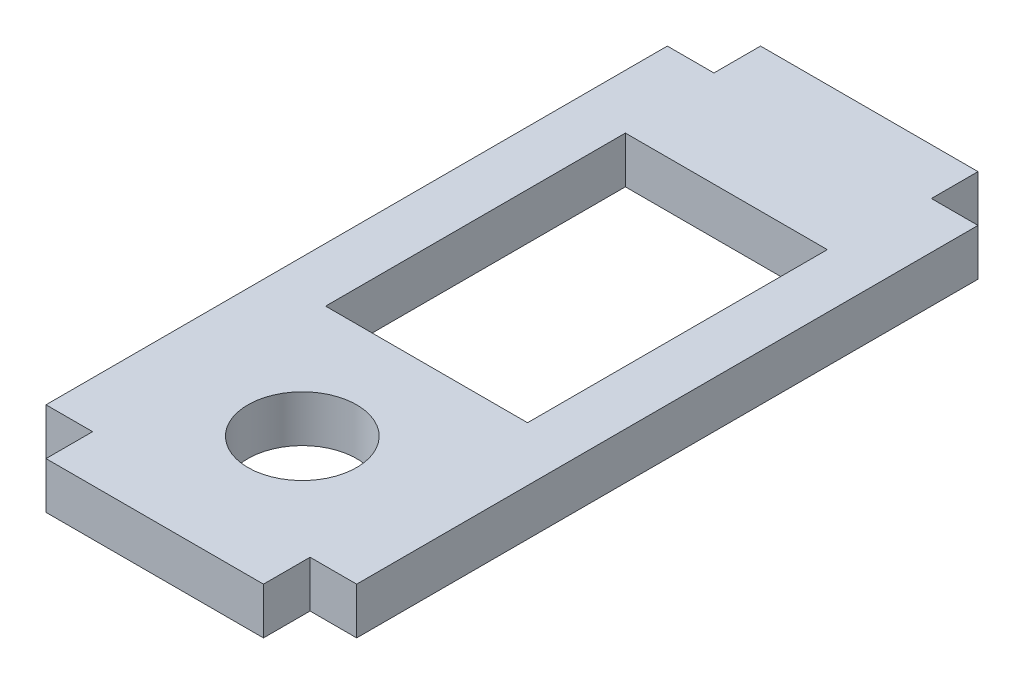
ISO-10303-21;
HEADER;
FILE_DESCRIPTION(('STEP AP214'),'2;1');
FILE_NAME('part.step','',(''),(''),'','','');
FILE_SCHEMA(('AUTOMOTIVE_DESIGN { 1 0 10303 214 1 1 1 1 }'));
ENDSEC;
DATA;
#1=APPLICATION_CONTEXT('core data for automotive mechanical design processes');
#2=APPLICATION_PROTOCOL_DEFINITION('international standard','automotive_design',2000,#1);
#3=PRODUCT_CONTEXT('',#1,'mechanical');
#4=PRODUCT('Part','Part','',(#3));
#5=PRODUCT_RELATED_PRODUCT_CATEGORY('part','',(#4));
#6=PRODUCT_DEFINITION_FORMATION('','',#4);
#7=PRODUCT_DEFINITION_CONTEXT('part definition',#1,'design');
#8=PRODUCT_DEFINITION('design','',#6,#7);
#9=PRODUCT_DEFINITION_SHAPE('','',#8);
#10=(LENGTH_UNIT() NAMED_UNIT(*) SI_UNIT(.MILLI.,.METRE.));
#11=(NAMED_UNIT(*) PLANE_ANGLE_UNIT() SI_UNIT($,.RADIAN.));
#12=(NAMED_UNIT(*) SI_UNIT($,.STERADIAN.) SOLID_ANGLE_UNIT());
#13=UNCERTAINTY_MEASURE_WITH_UNIT(LENGTH_MEASURE(1.E-05),#10,'distance_accuracy_value','');
#14=(GEOMETRIC_REPRESENTATION_CONTEXT(3) GLOBAL_UNCERTAINTY_ASSIGNED_CONTEXT((#13)) GLOBAL_UNIT_ASSIGNED_CONTEXT((#10,
#11,#12)) REPRESENTATION_CONTEXT('',''));
#15=CARTESIAN_POINT('',(0.,0.,0.));
#16=DIRECTION('',(0.,0.,1.));
#17=DIRECTION('',(1.,0.,0.));
#18=AXIS2_PLACEMENT_3D('',#15,#16,#17);
#19=CARTESIAN_POINT('',(0.,3.,0.));
#20=DIRECTION('',(0.,1.,0.));
#21=DIRECTION('',(0.,0.,1.));
#22=AXIS2_PLACEMENT_3D('',#19,#20,#21);
#23=PLANE('',#22);
#24=DIRECTION('',(1.,0.,0.));
#25=VECTOR('',#24,1.);
#26=CARTESIAN_POINT('',(-6.5,3.,5.5));
#27=LINE('',#26,#25);
#28=CARTESIAN_POINT('',(-6.5,3.,5.5));
#29=VERTEX_POINT('',#28);
#30=CARTESIAN_POINT('',(6.5,3.,5.5));
#31=VERTEX_POINT('',#30);
#32=EDGE_CURVE('E154',#29,#31,#27,.T.);
#33=ORIENTED_EDGE('',*,*,#32,.F.);
#34=DIRECTION('',(0.,0.,1.));
#35=VECTOR('',#34,1.);
#36=CARTESIAN_POINT('',(-6.5,3.,-13.8));
#37=LINE('',#36,#35);
#38=CARTESIAN_POINT('',(-6.5,3.,-13.8));
#39=VERTEX_POINT('',#38);
#40=EDGE_CURVE('E146',#39,#29,#37,.T.);
#41=ORIENTED_EDGE('',*,*,#40,.F.);
#42=DIRECTION('',(-1.,0.,0.));
#43=VECTOR('',#42,1.);
#44=CARTESIAN_POINT('',(-6.5,3.,-13.8));
#45=LINE('',#44,#43);
#46=CARTESIAN_POINT('',(6.5,3.,-13.8));
#47=VERTEX_POINT('',#46);
#48=EDGE_CURVE('E169',#47,#39,#45,.T.);
#49=ORIENTED_EDGE('',*,*,#48,.F.);
#50=DIRECTION('',(0.,0.,-1.));
#51=VECTOR('',#50,1.);
#52=CARTESIAN_POINT('',(6.5,3.,-13.8));
#53=LINE('',#52,#51);
#54=EDGE_CURVE('E167',#31,#47,#53,.T.);
#55=ORIENTED_EDGE('',*,*,#54,.F.);
#56=EDGE_LOOP('',(#33,#41,#49,#55));
#57=FACE_BOUND('',#56,.T.);
#58=DIRECTION('',(0.,0.,1.));
#59=VECTOR('',#58,1.);
#60=CARTESIAN_POINT('',(-10.,3.,-20.));
#61=LINE('',#60,#59);
#62=CARTESIAN_POINT('',(-10.,3.,-20.));
#63=VERTEX_POINT('',#62);
#64=CARTESIAN_POINT('',(-10.,3.,20.));
#65=VERTEX_POINT('',#64);
#66=EDGE_CURVE('E185',#63,#65,#61,.T.);
#67=ORIENTED_EDGE('',*,*,#66,.T.);
#68=DIRECTION('',(1.,0.,0.));
#69=VECTOR('',#68,1.);
#70=CARTESIAN_POINT('',(-10.,3.,20.));
#71=LINE('',#70,#69);
#72=CARTESIAN_POINT('',(-7.,3.,20.));
#73=VERTEX_POINT('',#72);
#74=EDGE_CURVE('E188',#65,#73,#71,.T.);
#75=ORIENTED_EDGE('',*,*,#74,.T.);
#76=DIRECTION('',(0.,0.,1.));
#77=VECTOR('',#76,1.);
#78=CARTESIAN_POINT('',(-7.,3.,20.));
#79=LINE('',#78,#77);
#80=CARTESIAN_POINT('',(-7.,3.,23.));
#81=VERTEX_POINT('',#80);
#82=EDGE_CURVE('E191',#73,#81,#79,.T.);
#83=ORIENTED_EDGE('',*,*,#82,.T.);
#84=DIRECTION('',(1.,0.,0.));
#85=VECTOR('',#84,1.);
#86=CARTESIAN_POINT('',(-7.,3.,23.));
#87=LINE('',#86,#85);
#88=CARTESIAN_POINT('',(7.,3.,23.));
#89=VERTEX_POINT('',#88);
#90=EDGE_CURVE('E193',#81,#89,#87,.T.);
#91=ORIENTED_EDGE('',*,*,#90,.T.);
#92=DIRECTION('',(0.,0.,-1.));
#93=VECTOR('',#92,1.);
#94=CARTESIAN_POINT('',(7.,3.,20.));
#95=LINE('',#94,#93);
#96=CARTESIAN_POINT('',(7.,3.,20.));
#97=VERTEX_POINT('',#96);
#98=EDGE_CURVE('E195',#89,#97,#95,.T.);
#99=ORIENTED_EDGE('',*,*,#98,.T.);
#100=DIRECTION('',(1.,0.,0.));
#101=VECTOR('',#100,1.);
#102=CARTESIAN_POINT('',(7.,3.,20.));
#103=LINE('',#102,#101);
#104=CARTESIAN_POINT('',(10.,3.,20.));
#105=VERTEX_POINT('',#104);
#106=EDGE_CURVE('E197',#97,#105,#103,.T.);
#107=ORIENTED_EDGE('',*,*,#106,.T.);
#108=DIRECTION('',(0.,0.,-1.));
#109=VECTOR('',#108,1.);
#110=CARTESIAN_POINT('',(10.,3.,-20.));
#111=LINE('',#110,#109);
#112=CARTESIAN_POINT('',(10.,3.,-20.));
#113=VERTEX_POINT('',#112);
#114=EDGE_CURVE('E199',#105,#113,#111,.T.);
#115=ORIENTED_EDGE('',*,*,#114,.T.);
#116=DIRECTION('',(-1.,0.,0.));
#117=VECTOR('',#116,1.);
#118=CARTESIAN_POINT('',(7.,3.,-20.));
#119=LINE('',#118,#117);
#120=CARTESIAN_POINT('',(7.,3.,-20.));
#121=VERTEX_POINT('',#120);
#122=EDGE_CURVE('E201',#113,#121,#119,.T.);
#123=ORIENTED_EDGE('',*,*,#122,.T.);
#124=DIRECTION('',(0.,0.,-1.));
#125=VECTOR('',#124,1.);
#126=CARTESIAN_POINT('',(7.,3.,-23.));
#127=LINE('',#126,#125);
#128=CARTESIAN_POINT('',(7.,3.,-23.));
#129=VERTEX_POINT('',#128);
#130=EDGE_CURVE('E203',#121,#129,#127,.T.);
#131=ORIENTED_EDGE('',*,*,#130,.T.);
#132=DIRECTION('',(-1.,0.,0.));
#133=VECTOR('',#132,1.);
#134=CARTESIAN_POINT('',(-7.,3.,-23.));
#135=LINE('',#134,#133);
#136=CARTESIAN_POINT('',(-7.,3.,-23.));
#137=VERTEX_POINT('',#136);
#138=EDGE_CURVE('E205',#129,#137,#135,.T.);
#139=ORIENTED_EDGE('',*,*,#138,.T.);
#140=DIRECTION('',(0.,0.,1.));
#141=VECTOR('',#140,1.);
#142=CARTESIAN_POINT('',(-7.,3.,-23.));
#143=LINE('',#142,#141);
#144=CARTESIAN_POINT('',(-7.,3.,-20.));
#145=VERTEX_POINT('',#144);
#146=EDGE_CURVE('E207',#137,#145,#143,.T.);
#147=ORIENTED_EDGE('',*,*,#146,.T.);
#148=DIRECTION('',(-1.,0.,0.));
#149=VECTOR('',#148,1.);
#150=CARTESIAN_POINT('',(-10.,3.,-20.));
#151=LINE('',#150,#149);
#152=EDGE_CURVE('E209',#145,#63,#151,.T.);
#153=ORIENTED_EDGE('',*,*,#152,.T.);
#154=EDGE_LOOP('',(#67,#75,#83,#91,#99,#107,#115,#123,#131,#139,#147,#153));
#155=FACE_BOUND('',#154,.T.);
#156=CARTESIAN_POINT('',(0.,3.,13.5));
#157=DIRECTION('',(0.,1.,0.));
#158=DIRECTION('',(0.,0.,1.));
#159=AXIS2_PLACEMENT_3D('',#156,#157,#158);
#160=CIRCLE('',#159,3.5);
#161=CARTESIAN_POINT('',(0.,3.,17.));
#162=VERTEX_POINT('',#161);
#163=EDGE_CURVE('E175',#162,#162,#160,.T.);
#164=ORIENTED_EDGE('',*,*,#163,.F.);
#165=EDGE_LOOP('',(#164));
#166=FACE_BOUND('',#165,.T.);
#167=ADVANCED_FACE('F33',(#57,#155,#166),#23,.T.);
#168=CARTESIAN_POINT('',(0.,0.,0.));
#169=DIRECTION('',(0.,1.,0.));
#170=DIRECTION('',(0.,0.,1.));
#171=AXIS2_PLACEMENT_3D('',#168,#169,#170);
#172=PLANE('',#171);
#173=DIRECTION('',(0.,0.,1.));
#174=VECTOR('',#173,1.);
#175=CARTESIAN_POINT('',(-6.5,0.,-13.8));
#176=LINE('',#175,#174);
#177=CARTESIAN_POINT('',(-6.5,0.,-13.8));
#178=VERTEX_POINT('',#177);
#179=CARTESIAN_POINT('',(-6.5,0.,5.5));
#180=VERTEX_POINT('',#179);
#181=EDGE_CURVE('E56',#178,#180,#176,.T.);
#182=ORIENTED_EDGE('',*,*,#181,.T.);
#183=DIRECTION('',(1.,0.,0.));
#184=VECTOR('',#183,1.);
#185=CARTESIAN_POINT('',(-6.5,0.,5.5));
#186=LINE('',#185,#184);
#187=CARTESIAN_POINT('',(6.5,0.,5.5));
#188=VERTEX_POINT('',#187);
#189=EDGE_CURVE('E161',#180,#188,#186,.T.);
#190=ORIENTED_EDGE('',*,*,#189,.T.);
#191=DIRECTION('',(0.,0.,-1.));
#192=VECTOR('',#191,1.);
#193=CARTESIAN_POINT('',(6.5,0.,-13.8));
#194=LINE('',#193,#192);
#195=CARTESIAN_POINT('',(6.5,0.,-13.8));
#196=VERTEX_POINT('',#195);
#197=EDGE_CURVE('E177',#188,#196,#194,.T.);
#198=ORIENTED_EDGE('',*,*,#197,.T.);
#199=DIRECTION('',(-1.,0.,0.));
#200=VECTOR('',#199,1.);
#201=CARTESIAN_POINT('',(-6.5,0.,-13.8));
#202=LINE('',#201,#200);
#203=EDGE_CURVE('E155',#196,#178,#202,.T.);
#204=ORIENTED_EDGE('',*,*,#203,.T.);
#205=EDGE_LOOP('',(#182,#190,#198,#204));
#206=FACE_BOUND('',#205,.T.);
#207=DIRECTION('',(0.,0.,1.));
#208=VECTOR('',#207,1.);
#209=CARTESIAN_POINT('',(-10.,0.,-20.));
#210=LINE('',#209,#208);
#211=CARTESIAN_POINT('',(-10.,0.,-20.));
#212=VERTEX_POINT('',#211);
#213=CARTESIAN_POINT('',(-10.,0.,20.));
#214=VERTEX_POINT('',#213);
#215=EDGE_CURVE('E162',#212,#214,#210,.T.);
#216=ORIENTED_EDGE('',*,*,#215,.F.);
#217=DIRECTION('',(-1.,0.,0.));
#218=VECTOR('',#217,1.);
#219=CARTESIAN_POINT('',(-10.,0.,-20.));
#220=LINE('',#219,#218);
#221=CARTESIAN_POINT('',(-7.,0.,-20.));
#222=VERTEX_POINT('',#221);
#223=EDGE_CURVE('E189',#222,#212,#220,.T.);
#224=ORIENTED_EDGE('',*,*,#223,.F.);
#225=DIRECTION('',(0.,0.,1.));
#226=VECTOR('',#225,1.);
#227=CARTESIAN_POINT('',(-7.,0.,-23.));
#228=LINE('',#227,#226);
#229=CARTESIAN_POINT('',(-7.,0.,-23.));
#230=VERTEX_POINT('',#229);
#231=EDGE_CURVE('E232',#230,#222,#228,.T.);
#232=ORIENTED_EDGE('',*,*,#231,.F.);
#233=DIRECTION('',(-1.,0.,0.));
#234=VECTOR('',#233,1.);
#235=CARTESIAN_POINT('',(-7.,0.,-23.));
#236=LINE('',#235,#234);
#237=CARTESIAN_POINT('',(7.,0.,-23.));
#238=VERTEX_POINT('',#237);
#239=EDGE_CURVE('E230',#238,#230,#236,.T.);
#240=ORIENTED_EDGE('',*,*,#239,.F.);
#241=DIRECTION('',(0.,0.,-1.));
#242=VECTOR('',#241,1.);
#243=CARTESIAN_POINT('',(7.,0.,-23.));
#244=LINE('',#243,#242);
#245=CARTESIAN_POINT('',(7.,0.,-20.));
#246=VERTEX_POINT('',#245);
#247=EDGE_CURVE('E228',#246,#238,#244,.T.);
#248=ORIENTED_EDGE('',*,*,#247,.F.);
#249=DIRECTION('',(-1.,0.,0.));
#250=VECTOR('',#249,1.);
#251=CARTESIAN_POINT('',(7.,0.,-20.));
#252=LINE('',#251,#250);
#253=CARTESIAN_POINT('',(10.,0.,-20.));
#254=VERTEX_POINT('',#253);
#255=EDGE_CURVE('E226',#254,#246,#252,.T.);
#256=ORIENTED_EDGE('',*,*,#255,.F.);
#257=DIRECTION('',(0.,0.,-1.));
#258=VECTOR('',#257,1.);
#259=CARTESIAN_POINT('',(10.,0.,-20.));
#260=LINE('',#259,#258);
#261=CARTESIAN_POINT('',(10.,0.,20.));
#262=VERTEX_POINT('',#261);
#263=EDGE_CURVE('E224',#262,#254,#260,.T.);
#264=ORIENTED_EDGE('',*,*,#263,.F.);
#265=DIRECTION('',(1.,0.,0.));
#266=VECTOR('',#265,1.);
#267=CARTESIAN_POINT('',(7.,0.,20.));
#268=LINE('',#267,#266);
#269=CARTESIAN_POINT('',(7.,0.,20.));
#270=VERTEX_POINT('',#269);
#271=EDGE_CURVE('E222',#270,#262,#268,.T.);
#272=ORIENTED_EDGE('',*,*,#271,.F.);
#273=DIRECTION('',(0.,0.,-1.));
#274=VECTOR('',#273,1.);
#275=CARTESIAN_POINT('',(7.,0.,20.));
#276=LINE('',#275,#274);
#277=CARTESIAN_POINT('',(7.,0.,23.));
#278=VERTEX_POINT('',#277);
#279=EDGE_CURVE('E220',#278,#270,#276,.T.);
#280=ORIENTED_EDGE('',*,*,#279,.F.);
#281=DIRECTION('',(1.,0.,0.));
#282=VECTOR('',#281,1.);
#283=CARTESIAN_POINT('',(-7.,0.,23.));
#284=LINE('',#283,#282);
#285=CARTESIAN_POINT('',(-7.,0.,23.));
#286=VERTEX_POINT('',#285);
#287=EDGE_CURVE('E218',#286,#278,#284,.T.);
#288=ORIENTED_EDGE('',*,*,#287,.F.);
#289=DIRECTION('',(0.,0.,1.));
#290=VECTOR('',#289,1.);
#291=CARTESIAN_POINT('',(-7.,0.,20.));
#292=LINE('',#291,#290);
#293=CARTESIAN_POINT('',(-7.,0.,20.));
#294=VERTEX_POINT('',#293);
#295=EDGE_CURVE('E216',#294,#286,#292,.T.);
#296=ORIENTED_EDGE('',*,*,#295,.F.);
#297=DIRECTION('',(1.,0.,0.));
#298=VECTOR('',#297,1.);
#299=CARTESIAN_POINT('',(-10.,0.,20.));
#300=LINE('',#299,#298);
#301=EDGE_CURVE('E214',#214,#294,#300,.T.);
#302=ORIENTED_EDGE('',*,*,#301,.F.);
#303=EDGE_LOOP('',(#216,#224,#232,#240,#248,#256,#264,#272,#280,#288,#296,#302));
#304=FACE_BOUND('',#303,.T.);
#305=CARTESIAN_POINT('',(0.,0.,13.5));
#306=DIRECTION('',(0.,1.,0.));
#307=DIRECTION('',(0.,0.,1.));
#308=AXIS2_PLACEMENT_3D('',#305,#306,#307);
#309=CIRCLE('',#308,3.5);
#310=CARTESIAN_POINT('',(0.,0.,17.));
#311=VERTEX_POINT('',#310);
#312=EDGE_CURVE('E486',#311,#311,#309,.T.);
#313=ORIENTED_EDGE('',*,*,#312,.T.);
#314=EDGE_LOOP('',(#313));
#315=FACE_BOUND('',#314,.T.);
#316=ADVANCED_FACE('F274',(#206,#304,#315),#172,.F.);
#317=CARTESIAN_POINT('',(-10.,3.,-20.));
#318=DIRECTION('',(1.,0.,0.));
#319=DIRECTION('',(0.,0.,-1.));
#320=AXIS2_PLACEMENT_3D('',#317,#318,#319);
#321=PLANE('',#320);
#322=ORIENTED_EDGE('',*,*,#215,.T.);
#323=DIRECTION('',(0.,-1.,0.));
#324=VECTOR('',#323,1.);
#325=CARTESIAN_POINT('',(-10.,3.,20.));
#326=LINE('',#325,#324);
#327=EDGE_CURVE('E11',#65,#214,#326,.T.);
#328=ORIENTED_EDGE('',*,*,#327,.F.);
#329=ORIENTED_EDGE('',*,*,#66,.F.);
#330=DIRECTION('',(0.,-1.,0.));
#331=VECTOR('',#330,1.);
#332=CARTESIAN_POINT('',(-10.,3.,-20.));
#333=LINE('',#332,#331);
#334=EDGE_CURVE('E211',#63,#212,#333,.T.);
#335=ORIENTED_EDGE('',*,*,#334,.T.);
#336=EDGE_LOOP('',(#322,#328,#329,#335));
#337=FACE_BOUND('',#336,.T.);
#338=ADVANCED_FACE('F35',(#337),#321,.F.);
#339=CARTESIAN_POINT('',(-10.,3.,20.));
#340=DIRECTION('',(0.,0.,-1.));
#341=DIRECTION('',(-1.,0.,0.));
#342=AXIS2_PLACEMENT_3D('',#339,#340,#341);
#343=PLANE('',#342);
#344=ORIENTED_EDGE('',*,*,#301,.T.);
#345=DIRECTION('',(0.,-1.,0.));
#346=VECTOR('',#345,1.);
#347=CARTESIAN_POINT('',(-7.,3.,20.));
#348=LINE('',#347,#346);
#349=EDGE_CURVE('E41',#73,#294,#348,.T.);
#350=ORIENTED_EDGE('',*,*,#349,.F.);
#351=ORIENTED_EDGE('',*,*,#74,.F.);
#352=ORIENTED_EDGE('',*,*,#327,.T.);
#353=EDGE_LOOP('',(#344,#350,#351,#352));
#354=FACE_BOUND('',#353,.T.);
#355=ADVANCED_FACE('F291',(#354),#343,.F.);
#356=CARTESIAN_POINT('',(-7.,3.,20.));
#357=DIRECTION('',(1.,0.,0.));
#358=DIRECTION('',(0.,0.,-1.));
#359=AXIS2_PLACEMENT_3D('',#356,#357,#358);
#360=PLANE('',#359);
#361=ORIENTED_EDGE('',*,*,#295,.T.);
#362=DIRECTION('',(0.,-1.,0.));
#363=VECTOR('',#362,1.);
#364=CARTESIAN_POINT('',(-7.,3.,23.));
#365=LINE('',#364,#363);
#366=EDGE_CURVE('E261',#81,#286,#365,.T.);
#367=ORIENTED_EDGE('',*,*,#366,.F.);
#368=ORIENTED_EDGE('',*,*,#82,.F.);
#369=ORIENTED_EDGE('',*,*,#349,.T.);
#370=EDGE_LOOP('',(#361,#367,#368,#369));
#371=FACE_BOUND('',#370,.T.);
#372=ADVANCED_FACE('F268',(#371),#360,.F.);
#373=CARTESIAN_POINT('',(-7.,3.,23.));
#374=DIRECTION('',(0.,0.,-1.));
#375=DIRECTION('',(-1.,0.,0.));
#376=AXIS2_PLACEMENT_3D('',#373,#374,#375);
#377=PLANE('',#376);
#378=ORIENTED_EDGE('',*,*,#287,.T.);
#379=DIRECTION('',(0.,-1.,0.));
#380=VECTOR('',#379,1.);
#381=CARTESIAN_POINT('',(7.,3.,23.));
#382=LINE('',#381,#380);
#383=EDGE_CURVE('E258',#89,#278,#382,.T.);
#384=ORIENTED_EDGE('',*,*,#383,.F.);
#385=ORIENTED_EDGE('',*,*,#90,.F.);
#386=ORIENTED_EDGE('',*,*,#366,.T.);
#387=EDGE_LOOP('',(#378,#384,#385,#386));
#388=FACE_BOUND('',#387,.T.);
#389=ADVANCED_FACE('F280',(#388),#377,.F.);
#390=CARTESIAN_POINT('',(7.,3.,20.));
#391=DIRECTION('',(-1.,0.,0.));
#392=DIRECTION('',(0.,0.,1.));
#393=AXIS2_PLACEMENT_3D('',#390,#391,#392);
#394=PLANE('',#393);
#395=ORIENTED_EDGE('',*,*,#279,.T.);
#396=DIRECTION('',(0.,-1.,0.));
#397=VECTOR('',#396,1.);
#398=CARTESIAN_POINT('',(7.,3.,20.));
#399=LINE('',#398,#397);
#400=EDGE_CURVE('E255',#97,#270,#399,.T.);
#401=ORIENTED_EDGE('',*,*,#400,.F.);
#402=ORIENTED_EDGE('',*,*,#98,.F.);
#403=ORIENTED_EDGE('',*,*,#383,.T.);
#404=EDGE_LOOP('',(#395,#401,#402,#403));
#405=FACE_BOUND('',#404,.T.);
#406=ADVANCED_FACE('F284',(#405),#394,.F.);
#407=CARTESIAN_POINT('',(7.,3.,20.));
#408=DIRECTION('',(0.,0.,-1.));
#409=DIRECTION('',(-1.,0.,0.));
#410=AXIS2_PLACEMENT_3D('',#407,#408,#409);
#411=PLANE('',#410);
#412=ORIENTED_EDGE('',*,*,#271,.T.);
#413=DIRECTION('',(0.,-1.,0.));
#414=VECTOR('',#413,1.);
#415=CARTESIAN_POINT('',(10.,3.,20.));
#416=LINE('',#415,#414);
#417=EDGE_CURVE('E252',#105,#262,#416,.T.);
#418=ORIENTED_EDGE('',*,*,#417,.F.);
#419=ORIENTED_EDGE('',*,*,#106,.F.);
#420=ORIENTED_EDGE('',*,*,#400,.T.);
#421=EDGE_LOOP('',(#412,#418,#419,#420));
#422=FACE_BOUND('',#421,.T.);
#423=ADVANCED_FACE('F324',(#422),#411,.F.);
#424=CARTESIAN_POINT('',(10.,3.,-20.));
#425=DIRECTION('',(-1.,0.,0.));
#426=DIRECTION('',(0.,0.,1.));
#427=AXIS2_PLACEMENT_3D('',#424,#425,#426);
#428=PLANE('',#427);
#429=ORIENTED_EDGE('',*,*,#263,.T.);
#430=DIRECTION('',(0.,-1.,0.));
#431=VECTOR('',#430,1.);
#432=CARTESIAN_POINT('',(10.,3.,-20.));
#433=LINE('',#432,#431);
#434=EDGE_CURVE('E249',#113,#254,#433,.T.);
#435=ORIENTED_EDGE('',*,*,#434,.F.);
#436=ORIENTED_EDGE('',*,*,#114,.F.);
#437=ORIENTED_EDGE('',*,*,#417,.T.);
#438=EDGE_LOOP('',(#429,#435,#436,#437));
#439=FACE_BOUND('',#438,.T.);
#440=ADVANCED_FACE('F322',(#439),#428,.F.);
#441=CARTESIAN_POINT('',(7.,3.,-20.));
#442=DIRECTION('',(0.,0.,1.));
#443=DIRECTION('',(1.,0.,0.));
#444=AXIS2_PLACEMENT_3D('',#441,#442,#443);
#445=PLANE('',#444);
#446=ORIENTED_EDGE('',*,*,#255,.T.);
#447=DIRECTION('',(0.,-1.,0.));
#448=VECTOR('',#447,1.);
#449=CARTESIAN_POINT('',(7.,3.,-20.));
#450=LINE('',#449,#448);
#451=EDGE_CURVE('E246',#121,#246,#450,.T.);
#452=ORIENTED_EDGE('',*,*,#451,.F.);
#453=ORIENTED_EDGE('',*,*,#122,.F.);
#454=ORIENTED_EDGE('',*,*,#434,.T.);
#455=EDGE_LOOP('',(#446,#452,#453,#454));
#456=FACE_BOUND('',#455,.T.);
#457=ADVANCED_FACE('F318',(#456),#445,.F.);
#458=CARTESIAN_POINT('',(7.,3.,-23.));
#459=DIRECTION('',(-1.,0.,0.));
#460=DIRECTION('',(0.,0.,1.));
#461=AXIS2_PLACEMENT_3D('',#458,#459,#460);
#462=PLANE('',#461);
#463=ORIENTED_EDGE('',*,*,#247,.T.);
#464=DIRECTION('',(0.,-1.,0.));
#465=VECTOR('',#464,1.);
#466=CARTESIAN_POINT('',(7.,3.,-23.));
#467=LINE('',#466,#465);
#468=EDGE_CURVE('E243',#129,#238,#467,.T.);
#469=ORIENTED_EDGE('',*,*,#468,.F.);
#470=ORIENTED_EDGE('',*,*,#130,.F.);
#471=ORIENTED_EDGE('',*,*,#451,.T.);
#472=EDGE_LOOP('',(#463,#469,#470,#471));
#473=FACE_BOUND('',#472,.T.);
#474=ADVANCED_FACE('F313',(#473),#462,.F.);
#475=CARTESIAN_POINT('',(-7.,3.,-23.));
#476=DIRECTION('',(0.,0.,1.));
#477=DIRECTION('',(1.,0.,0.));
#478=AXIS2_PLACEMENT_3D('',#475,#476,#477);
#479=PLANE('',#478);
#480=ORIENTED_EDGE('',*,*,#239,.T.);
#481=DIRECTION('',(0.,-1.,0.));
#482=VECTOR('',#481,1.);
#483=CARTESIAN_POINT('',(-7.,3.,-23.));
#484=LINE('',#483,#482);
#485=EDGE_CURVE('E240',#137,#230,#484,.T.);
#486=ORIENTED_EDGE('',*,*,#485,.F.);
#487=ORIENTED_EDGE('',*,*,#138,.F.);
#488=ORIENTED_EDGE('',*,*,#468,.T.);
#489=EDGE_LOOP('',(#480,#486,#487,#488));
#490=FACE_BOUND('',#489,.T.);
#491=ADVANCED_FACE('F307',(#490),#479,.F.);
#492=CARTESIAN_POINT('',(-7.,3.,-23.));
#493=DIRECTION('',(1.,0.,0.));
#494=DIRECTION('',(0.,0.,-1.));
#495=AXIS2_PLACEMENT_3D('',#492,#493,#494);
#496=PLANE('',#495);
#497=ORIENTED_EDGE('',*,*,#231,.T.);
#498=DIRECTION('',(0.,-1.,0.));
#499=VECTOR('',#498,1.);
#500=CARTESIAN_POINT('',(-7.,3.,-20.));
#501=LINE('',#500,#499);
#502=EDGE_CURVE('E237',#145,#222,#501,.T.);
#503=ORIENTED_EDGE('',*,*,#502,.F.);
#504=ORIENTED_EDGE('',*,*,#146,.F.);
#505=ORIENTED_EDGE('',*,*,#485,.T.);
#506=EDGE_LOOP('',(#497,#503,#504,#505));
#507=FACE_BOUND('',#506,.T.);
#508=ADVANCED_FACE('F303',(#507),#496,.F.);
#509=CARTESIAN_POINT('',(-10.,3.,-20.));
#510=DIRECTION('',(0.,0.,1.));
#511=DIRECTION('',(1.,0.,0.));
#512=AXIS2_PLACEMENT_3D('',#509,#510,#511);
#513=PLANE('',#512);
#514=ORIENTED_EDGE('',*,*,#223,.T.);
#515=ORIENTED_EDGE('',*,*,#334,.F.);
#516=ORIENTED_EDGE('',*,*,#152,.F.);
#517=ORIENTED_EDGE('',*,*,#502,.T.);
#518=EDGE_LOOP('',(#514,#515,#516,#517));
#519=FACE_BOUND('',#518,.T.);
#520=ADVANCED_FACE('F298',(#519),#513,.F.);
#521=CARTESIAN_POINT('',(-6.5,3.,-13.8));
#522=DIRECTION('',(1.,0.,0.));
#523=DIRECTION('',(0.,0.,-1.));
#524=AXIS2_PLACEMENT_3D('',#521,#522,#523);
#525=PLANE('',#524);
#526=ORIENTED_EDGE('',*,*,#181,.F.);
#527=DIRECTION('',(0.,-1.,0.));
#528=VECTOR('',#527,1.);
#529=CARTESIAN_POINT('',(-6.5,3.,-13.8));
#530=LINE('',#529,#528);
#531=EDGE_CURVE('E150',#39,#178,#530,.T.);
#532=ORIENTED_EDGE('',*,*,#531,.F.);
#533=ORIENTED_EDGE('',*,*,#40,.T.);
#534=DIRECTION('',(0.,-1.,0.));
#535=VECTOR('',#534,1.);
#536=CARTESIAN_POINT('',(-6.5,3.,5.5));
#537=LINE('',#536,#535);
#538=EDGE_CURVE('E149',#29,#180,#537,.T.);
#539=ORIENTED_EDGE('',*,*,#538,.T.);
#540=EDGE_LOOP('',(#526,#532,#533,#539));
#541=FACE_BOUND('',#540,.T.);
#542=ADVANCED_FACE('F148',(#541),#525,.T.);
#543=CARTESIAN_POINT('',(-6.5,3.,5.5));
#544=DIRECTION('',(0.,0.,-1.));
#545=DIRECTION('',(-1.,0.,0.));
#546=AXIS2_PLACEMENT_3D('',#543,#544,#545);
#547=PLANE('',#546);
#548=ORIENTED_EDGE('',*,*,#189,.F.);
#549=ORIENTED_EDGE('',*,*,#538,.F.);
#550=ORIENTED_EDGE('',*,*,#32,.T.);
#551=DIRECTION('',(0.,-1.,0.));
#552=VECTOR('',#551,1.);
#553=CARTESIAN_POINT('',(6.5,3.,5.5));
#554=LINE('',#553,#552);
#555=EDGE_CURVE('E163',#31,#188,#554,.T.);
#556=ORIENTED_EDGE('',*,*,#555,.T.);
#557=EDGE_LOOP('',(#548,#549,#550,#556));
#558=FACE_BOUND('',#557,.T.);
#559=ADVANCED_FACE('F158',(#558),#547,.T.);
#560=CARTESIAN_POINT('',(6.5,3.,-13.8));
#561=DIRECTION('',(-1.,0.,0.));
#562=DIRECTION('',(0.,0.,1.));
#563=AXIS2_PLACEMENT_3D('',#560,#561,#562);
#564=PLANE('',#563);
#565=ORIENTED_EDGE('',*,*,#197,.F.);
#566=ORIENTED_EDGE('',*,*,#555,.F.);
#567=ORIENTED_EDGE('',*,*,#54,.T.);
#568=DIRECTION('',(0.,-1.,0.));
#569=VECTOR('',#568,1.);
#570=CARTESIAN_POINT('',(6.5,3.,-13.8));
#571=LINE('',#570,#569);
#572=EDGE_CURVE('E48',#47,#196,#571,.T.);
#573=ORIENTED_EDGE('',*,*,#572,.T.);
#574=EDGE_LOOP('',(#565,#566,#567,#573));
#575=FACE_BOUND('',#574,.T.);
#576=ADVANCED_FACE('F383',(#575),#564,.T.);
#577=CARTESIAN_POINT('',(-6.5,3.,-13.8));
#578=DIRECTION('',(0.,0.,1.));
#579=DIRECTION('',(1.,0.,0.));
#580=AXIS2_PLACEMENT_3D('',#577,#578,#579);
#581=PLANE('',#580);
#582=ORIENTED_EDGE('',*,*,#203,.F.);
#583=ORIENTED_EDGE('',*,*,#572,.F.);
#584=ORIENTED_EDGE('',*,*,#48,.T.);
#585=ORIENTED_EDGE('',*,*,#531,.T.);
#586=EDGE_LOOP('',(#582,#583,#584,#585));
#587=FACE_BOUND('',#586,.T.);
#588=ADVANCED_FACE('F389',(#587),#581,.T.);
#589=CARTESIAN_POINT('',(0.,3.,13.5));
#590=DIRECTION('',(0.,-1.,0.));
#591=DIRECTION('',(0.,0.,-1.));
#592=AXIS2_PLACEMENT_3D('',#589,#590,#591);
#593=CYLINDRICAL_SURFACE('',#592,3.5);
#594=ORIENTED_EDGE('',*,*,#163,.T.);
#595=EDGE_LOOP('',(#594));
#596=FACE_BOUND('',#595,.T.);
#597=ORIENTED_EDGE('',*,*,#312,.F.);
#598=EDGE_LOOP('',(#597));
#599=FACE_BOUND('',#598,.T.);
#600=ADVANCED_FACE('F397',(#596,#599),#593,.F.);
#601=CLOSED_SHELL('',(#167,#316,#338,#355,#372,#389,#406,#423,#440,#457,#474,#491,#508,#520,
#542,#559,#576,#588,#600));
#602=MANIFOLD_SOLID_BREP('B2',#601);
#603=ADVANCED_BREP_SHAPE_REPRESENTATION('',(#18,#602),#14);
#604=SHAPE_DEFINITION_REPRESENTATION(#9,#603);
ENDSEC;
END-ISO-10303-21;
